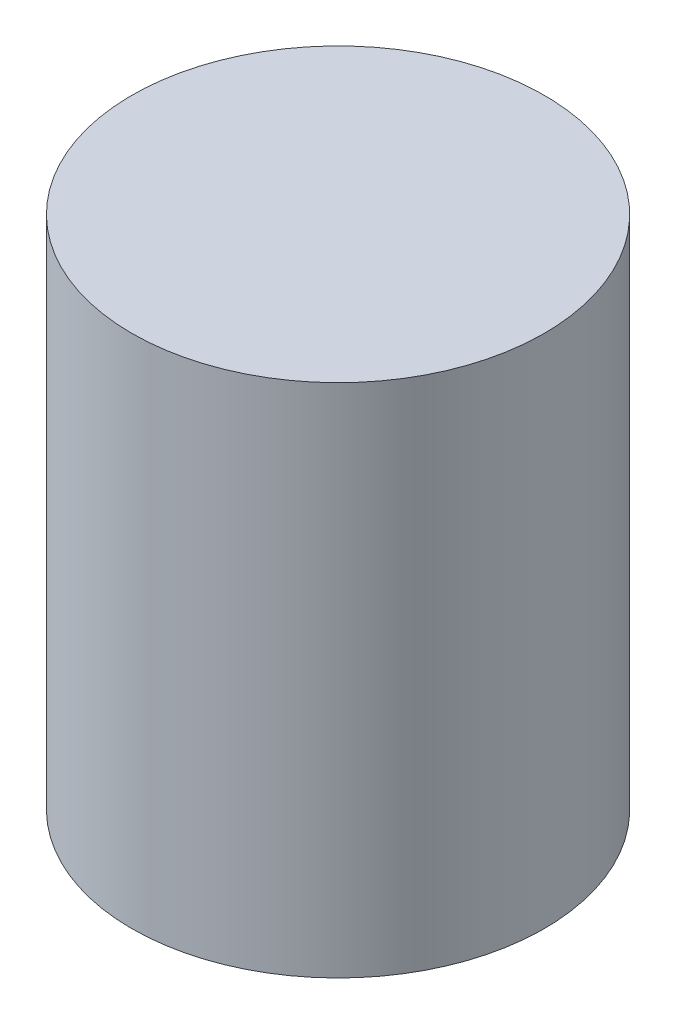
ISO-10303-21;
HEADER;
FILE_DESCRIPTION(('STEP AP214'),'2;1');
FILE_NAME('part.step','',(''),(''),'','','');
FILE_SCHEMA(('AUTOMOTIVE_DESIGN { 1 0 10303 214 1 1 1 1 }'));
ENDSEC;
DATA;
#1=APPLICATION_CONTEXT('core data for automotive mechanical design processes');
#2=APPLICATION_PROTOCOL_DEFINITION('international standard','automotive_design',2000,#1);
#3=PRODUCT_CONTEXT('',#1,'mechanical');
#4=PRODUCT('Part','Part','',(#3));
#5=PRODUCT_RELATED_PRODUCT_CATEGORY('part','',(#4));
#6=PRODUCT_DEFINITION_FORMATION('','',#4);
#7=PRODUCT_DEFINITION_CONTEXT('part definition',#1,'design');
#8=PRODUCT_DEFINITION('design','',#6,#7);
#9=PRODUCT_DEFINITION_SHAPE('','',#8);
#10=(LENGTH_UNIT() NAMED_UNIT(*) SI_UNIT(.MILLI.,.METRE.));
#11=(NAMED_UNIT(*) PLANE_ANGLE_UNIT() SI_UNIT($,.RADIAN.));
#12=(NAMED_UNIT(*) SI_UNIT($,.STERADIAN.) SOLID_ANGLE_UNIT());
#13=UNCERTAINTY_MEASURE_WITH_UNIT(LENGTH_MEASURE(1.E-05),#10,'distance_accuracy_value','');
#14=(GEOMETRIC_REPRESENTATION_CONTEXT(3) GLOBAL_UNCERTAINTY_ASSIGNED_CONTEXT((#13)) GLOBAL_UNIT_ASSIGNED_CONTEXT((#10,
#11,#12)) REPRESENTATION_CONTEXT('',''));
#15=CARTESIAN_POINT('',(0.,0.,0.));
#16=DIRECTION('',(0.,0.,1.));
#17=DIRECTION('',(1.,0.,0.));
#18=AXIS2_PLACEMENT_3D('',#15,#16,#17);
#19=CARTESIAN_POINT('',(0.,20.,0.));
#20=DIRECTION('',(0.,-1.,0.));
#21=DIRECTION('',(0.,0.,-1.));
#22=AXIS2_PLACEMENT_3D('',#19,#20,#21);
#23=CYLINDRICAL_SURFACE('',#22,8.);
#24=CARTESIAN_POINT('',(0.,20.,0.));
#25=DIRECTION('',(0.,1.,0.));
#26=DIRECTION('',(0.,0.,1.));
#27=AXIS2_PLACEMENT_3D('',#24,#25,#26);
#28=CIRCLE('',#27,8.);
#29=CARTESIAN_POINT('',(0.,20.,8.));
#30=VERTEX_POINT('',#29);
#31=EDGE_CURVE('E10',#30,#30,#28,.T.);
#32=ORIENTED_EDGE('',*,*,#31,.F.);
#33=EDGE_LOOP('',(#32));
#34=FACE_BOUND('',#33,.T.);
#35=CARTESIAN_POINT('',(0.,0.,0.));
#36=DIRECTION('',(0.,1.,0.));
#37=DIRECTION('',(0.,0.,1.));
#38=AXIS2_PLACEMENT_3D('',#35,#36,#37);
#39=CIRCLE('',#38,8.);
#40=CARTESIAN_POINT('',(0.,0.,8.));
#41=VERTEX_POINT('',#40);
#42=EDGE_CURVE('E36',#41,#41,#39,.T.);
#43=ORIENTED_EDGE('',*,*,#42,.T.);
#44=EDGE_LOOP('',(#43));
#45=FACE_BOUND('',#44,.T.);
#46=ADVANCED_FACE('F33',(#34,#45),#23,.T.);
#47=CARTESIAN_POINT('',(0.,20.,0.));
#48=DIRECTION('',(0.,1.,0.));
#49=DIRECTION('',(0.,0.,1.));
#50=AXIS2_PLACEMENT_3D('',#47,#48,#49);
#51=PLANE('',#50);
#52=ORIENTED_EDGE('',*,*,#31,.T.);
#53=EDGE_LOOP('',(#52));
#54=FACE_BOUND('',#53,.T.);
#55=ADVANCED_FACE('F48',(#54),#51,.T.);
#56=CARTESIAN_POINT('',(0.,0.,0.));
#57=DIRECTION('',(0.,1.,0.));
#58=DIRECTION('',(0.,0.,1.));
#59=AXIS2_PLACEMENT_3D('',#56,#57,#58);
#60=PLANE('',#59);
#61=ORIENTED_EDGE('',*,*,#42,.F.);
#62=EDGE_LOOP('',(#61));
#63=FACE_BOUND('',#62,.T.);
#64=ADVANCED_FACE('F46',(#63),#60,.F.);
#65=CLOSED_SHELL('',(#46,#55,#64));
#66=MANIFOLD_SOLID_BREP('B2',#65);
#67=ADVANCED_BREP_SHAPE_REPRESENTATION('',(#18,#66),#14);
#68=SHAPE_DEFINITION_REPRESENTATION(#9,#67);
ENDSEC;
END-ISO-10303-21;
